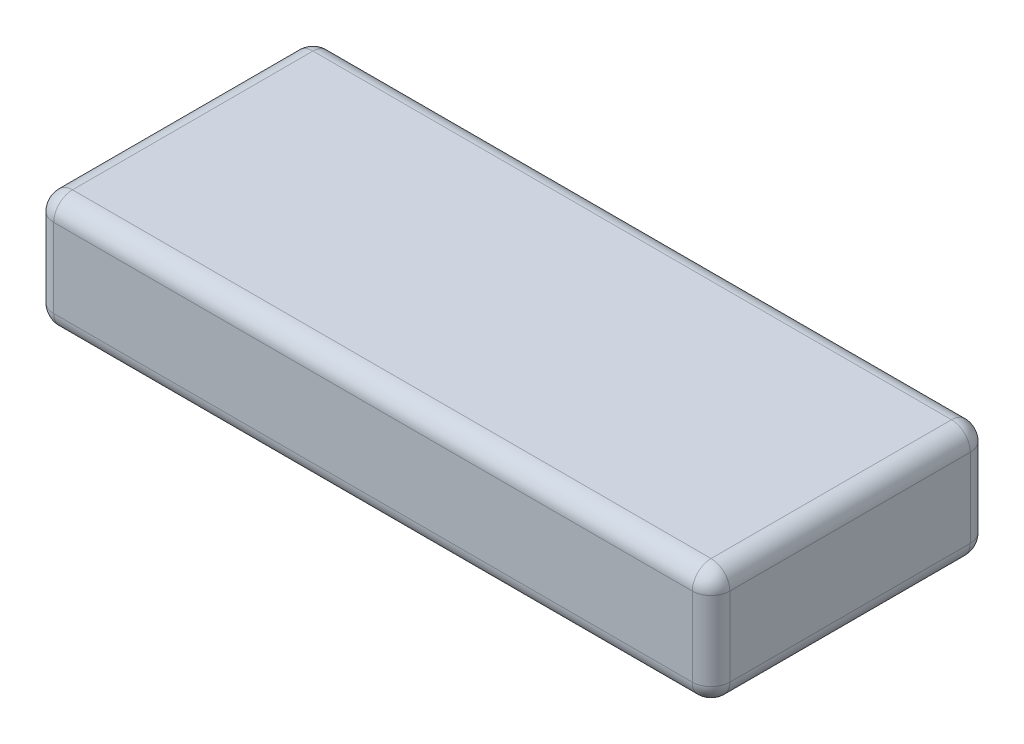
ISO-10303-21;
HEADER;
FILE_DESCRIPTION(('STEP AP214'),'2;1');
FILE_NAME('part.step','',(''),(''),'','','');
FILE_SCHEMA(('AUTOMOTIVE_DESIGN { 1 0 10303 214 1 1 1 1 }'));
ENDSEC;
DATA;
#1=APPLICATION_CONTEXT('core data for automotive mechanical design processes');
#2=APPLICATION_PROTOCOL_DEFINITION('international standard','automotive_design',2000,#1);
#3=PRODUCT_CONTEXT('',#1,'mechanical');
#4=PRODUCT('Part','Part','',(#3));
#5=PRODUCT_RELATED_PRODUCT_CATEGORY('part','',(#4));
#6=PRODUCT_DEFINITION_FORMATION('','',#4);
#7=PRODUCT_DEFINITION_CONTEXT('part definition',#1,'design');
#8=PRODUCT_DEFINITION('design','',#6,#7);
#9=PRODUCT_DEFINITION_SHAPE('','',#8);
#10=(LENGTH_UNIT() NAMED_UNIT(*) SI_UNIT(.MILLI.,.METRE.));
#11=(NAMED_UNIT(*) PLANE_ANGLE_UNIT() SI_UNIT($,.RADIAN.));
#12=(NAMED_UNIT(*) SI_UNIT($,.STERADIAN.) SOLID_ANGLE_UNIT());
#13=UNCERTAINTY_MEASURE_WITH_UNIT(LENGTH_MEASURE(1.E-05),#10,'distance_accuracy_value','');
#14=(GEOMETRIC_REPRESENTATION_CONTEXT(3) GLOBAL_UNCERTAINTY_ASSIGNED_CONTEXT((#13)) GLOBAL_UNIT_ASSIGNED_CONTEXT((#10,
#11,#12)) REPRESENTATION_CONTEXT('',''));
#15=CARTESIAN_POINT('',(0.,0.,0.));
#16=DIRECTION('',(0.,0.,1.));
#17=DIRECTION('',(1.,0.,0.));
#18=AXIS2_PLACEMENT_3D('',#15,#16,#17);
#19=CARTESIAN_POINT('',(90.,31.,37.));
#20=DIRECTION('',(-1.,0.,0.));
#21=DIRECTION('',(0.,0.,1.));
#22=AXIS2_PLACEMENT_3D('',#19,#20,#21);
#23=PLANE('',#22);
#24=DIRECTION('',(0.,-1.,0.));
#25=VECTOR('',#24,1.);
#26=CARTESIAN_POINT('',(90.,31.,32.));
#27=LINE('',#26,#25);
#28=CARTESIAN_POINT('',(90.,26.,32.));
#29=VERTEX_POINT('',#28);
#30=CARTESIAN_POINT('',(90.,5.,32.));
#31=VERTEX_POINT('',#30);
#32=EDGE_CURVE('E218',#29,#31,#27,.T.);
#33=ORIENTED_EDGE('',*,*,#32,.T.);
#34=DIRECTION('',(0.,0.,-1.));
#35=VECTOR('',#34,1.);
#36=CARTESIAN_POINT('',(90.,5.,-37.));
#37=LINE('',#36,#35);
#38=CARTESIAN_POINT('',(90.,5.,-32.));
#39=VERTEX_POINT('',#38);
#40=EDGE_CURVE('E220',#31,#39,#37,.T.);
#41=ORIENTED_EDGE('',*,*,#40,.T.);
#42=DIRECTION('',(0.,-1.,0.));
#43=VECTOR('',#42,1.);
#44=CARTESIAN_POINT('',(90.,31.,-32.));
#45=LINE('',#44,#43);
#46=CARTESIAN_POINT('',(90.,26.,-32.));
#47=VERTEX_POINT('',#46);
#48=EDGE_CURVE('E221',#39,#47,#45,.F.);
#49=ORIENTED_EDGE('',*,*,#48,.T.);
#50=DIRECTION('',(0.,0.,-1.));
#51=VECTOR('',#50,1.);
#52=CARTESIAN_POINT('',(90.,26.,37.));
#53=LINE('',#52,#51);
#54=EDGE_CURVE('E225',#47,#29,#53,.F.);
#55=ORIENTED_EDGE('',*,*,#54,.T.);
#56=EDGE_LOOP('',(#33,#41,#49,#55));
#57=FACE_BOUND('',#56,.T.);
#58=ADVANCED_FACE('F35',(#57),#23,.F.);
#59=CARTESIAN_POINT('',(-90.,31.,-37.));
#60=DIRECTION('',(0.,0.,1.));
#61=DIRECTION('',(1.,0.,0.));
#62=AXIS2_PLACEMENT_3D('',#59,#60,#61);
#63=PLANE('',#62);
#64=DIRECTION('',(0.,-1.,0.));
#65=VECTOR('',#64,1.);
#66=CARTESIAN_POINT('',(85.,31.,-37.));
#67=LINE('',#66,#65);
#68=CARTESIAN_POINT('',(85.,26.,-37.));
#69=VERTEX_POINT('',#68);
#70=CARTESIAN_POINT('',(85.,5.,-37.));
#71=VERTEX_POINT('',#70);
#72=EDGE_CURVE('E133',#69,#71,#67,.T.);
#73=ORIENTED_EDGE('',*,*,#72,.T.);
#74=DIRECTION('',(-1.,0.,0.));
#75=VECTOR('',#74,1.);
#76=CARTESIAN_POINT('',(-90.,5.,-37.));
#77=LINE('',#76,#75);
#78=CARTESIAN_POINT('',(-85.,5.,-37.));
#79=VERTEX_POINT('',#78);
#80=EDGE_CURVE('E129',#71,#79,#77,.T.);
#81=ORIENTED_EDGE('',*,*,#80,.T.);
#82=DIRECTION('',(0.,-1.,0.));
#83=VECTOR('',#82,1.);
#84=CARTESIAN_POINT('',(-85.,31.,-37.));
#85=LINE('',#84,#83);
#86=CARTESIAN_POINT('',(-85.,26.,-37.));
#87=VERTEX_POINT('',#86);
#88=EDGE_CURVE('E123',#79,#87,#85,.F.);
#89=ORIENTED_EDGE('',*,*,#88,.T.);
#90=DIRECTION('',(-1.,0.,0.));
#91=VECTOR('',#90,1.);
#92=CARTESIAN_POINT('',(-90.,26.,-37.));
#93=LINE('',#92,#91);
#94=EDGE_CURVE('E126',#87,#69,#93,.F.);
#95=ORIENTED_EDGE('',*,*,#94,.T.);
#96=EDGE_LOOP('',(#73,#81,#89,#95));
#97=FACE_BOUND('',#96,.T.);
#98=ADVANCED_FACE('F125',(#97),#63,.F.);
#99=CARTESIAN_POINT('',(-90.,31.,37.));
#100=DIRECTION('',(1.,0.,0.));
#101=DIRECTION('',(0.,0.,-1.));
#102=AXIS2_PLACEMENT_3D('',#99,#100,#101);
#103=PLANE('',#102);
#104=DIRECTION('',(0.,0.,1.));
#105=VECTOR('',#104,1.);
#106=CARTESIAN_POINT('',(-90.,26.,37.));
#107=LINE('',#106,#105);
#108=CARTESIAN_POINT('',(-90.,26.,32.));
#109=VERTEX_POINT('',#108);
#110=CARTESIAN_POINT('',(-90.,26.,-32.));
#111=VERTEX_POINT('',#110);
#112=EDGE_CURVE('E267',#109,#111,#107,.F.);
#113=ORIENTED_EDGE('',*,*,#112,.T.);
#114=DIRECTION('',(0.,-1.,0.));
#115=VECTOR('',#114,1.);
#116=CARTESIAN_POINT('',(-90.,31.,-32.));
#117=LINE('',#116,#115);
#118=CARTESIAN_POINT('',(-90.,5.,-32.));
#119=VERTEX_POINT('',#118);
#120=EDGE_CURVE('E155',#111,#119,#117,.T.);
#121=ORIENTED_EDGE('',*,*,#120,.T.);
#122=DIRECTION('',(0.,0.,1.));
#123=VECTOR('',#122,1.);
#124=CARTESIAN_POINT('',(-90.,5.,37.));
#125=LINE('',#124,#123);
#126=CARTESIAN_POINT('',(-90.,5.,32.));
#127=VERTEX_POINT('',#126);
#128=EDGE_CURVE('E275',#119,#127,#125,.T.);
#129=ORIENTED_EDGE('',*,*,#128,.T.);
#130=DIRECTION('',(0.,-1.,0.));
#131=VECTOR('',#130,1.);
#132=CARTESIAN_POINT('',(-90.,31.,32.));
#133=LINE('',#132,#131);
#134=EDGE_CURVE('E269',#127,#109,#133,.F.);
#135=ORIENTED_EDGE('',*,*,#134,.T.);
#136=EDGE_LOOP('',(#113,#121,#129,#135));
#137=FACE_BOUND('',#136,.T.);
#138=ADVANCED_FACE('F322',(#137),#103,.F.);
#139=CARTESIAN_POINT('',(-90.,31.,37.));
#140=DIRECTION('',(0.,0.,-1.));
#141=DIRECTION('',(-1.,0.,0.));
#142=AXIS2_PLACEMENT_3D('',#139,#140,#141);
#143=PLANE('',#142);
#144=DIRECTION('',(1.,0.,0.));
#145=VECTOR('',#144,1.);
#146=CARTESIAN_POINT('',(-90.,26.,37.));
#147=LINE('',#146,#145);
#148=CARTESIAN_POINT('',(85.,26.,37.));
#149=VERTEX_POINT('',#148);
#150=CARTESIAN_POINT('',(-85.,26.,37.));
#151=VERTEX_POINT('',#150);
#152=EDGE_CURVE('E278',#149,#151,#147,.F.);
#153=ORIENTED_EDGE('',*,*,#152,.T.);
#154=DIRECTION('',(0.,-1.,0.));
#155=VECTOR('',#154,1.);
#156=CARTESIAN_POINT('',(-85.,31.,37.));
#157=LINE('',#156,#155);
#158=CARTESIAN_POINT('',(-85.,5.,37.));
#159=VERTEX_POINT('',#158);
#160=EDGE_CURVE('E283',#151,#159,#157,.T.);
#161=ORIENTED_EDGE('',*,*,#160,.T.);
#162=DIRECTION('',(1.,0.,0.));
#163=VECTOR('',#162,1.);
#164=CARTESIAN_POINT('',(90.,5.,37.));
#165=LINE('',#164,#163);
#166=CARTESIAN_POINT('',(85.,5.,37.));
#167=VERTEX_POINT('',#166);
#168=EDGE_CURVE('E281',#159,#167,#165,.T.);
#169=ORIENTED_EDGE('',*,*,#168,.T.);
#170=DIRECTION('',(0.,-1.,0.));
#171=VECTOR('',#170,1.);
#172=CARTESIAN_POINT('',(85.,31.,37.));
#173=LINE('',#172,#171);
#174=EDGE_CURVE('E215',#167,#149,#173,.F.);
#175=ORIENTED_EDGE('',*,*,#174,.T.);
#176=EDGE_LOOP('',(#153,#161,#169,#175));
#177=FACE_BOUND('',#176,.T.);
#178=ADVANCED_FACE('F300',(#177),#143,.F.);
#179=CARTESIAN_POINT('',(0.,31.,0.));
#180=DIRECTION('',(0.,-1.,0.));
#181=DIRECTION('',(0.,0.,-1.));
#182=AXIS2_PLACEMENT_3D('',#179,#180,#181);
#183=PLANE('',#182);
#184=DIRECTION('',(0.,0.,1.));
#185=VECTOR('',#184,1.);
#186=CARTESIAN_POINT('',(-85.,31.,0.));
#187=LINE('',#186,#185);
#188=CARTESIAN_POINT('',(-85.,31.,-32.));
#189=VERTEX_POINT('',#188);
#190=CARTESIAN_POINT('',(-85.,31.,32.));
#191=VERTEX_POINT('',#190);
#192=EDGE_CURVE('E44',#189,#191,#187,.T.);
#193=ORIENTED_EDGE('',*,*,#192,.T.);
#194=DIRECTION('',(1.,0.,0.));
#195=VECTOR('',#194,1.);
#196=CARTESIAN_POINT('',(0.,31.,32.));
#197=LINE('',#196,#195);
#198=CARTESIAN_POINT('',(85.,31.,32.));
#199=VERTEX_POINT('',#198);
#200=EDGE_CURVE('E11',#191,#199,#197,.T.);
#201=ORIENTED_EDGE('',*,*,#200,.T.);
#202=DIRECTION('',(0.,0.,-1.));
#203=VECTOR('',#202,1.);
#204=CARTESIAN_POINT('',(85.,31.,0.));
#205=LINE('',#204,#203);
#206=CARTESIAN_POINT('',(85.,31.,-32.));
#207=VERTEX_POINT('',#206);
#208=EDGE_CURVE('E223',#199,#207,#205,.T.);
#209=ORIENTED_EDGE('',*,*,#208,.T.);
#210=DIRECTION('',(-1.,0.,0.));
#211=VECTOR('',#210,1.);
#212=CARTESIAN_POINT('',(0.,31.,-32.));
#213=LINE('',#212,#211);
#214=EDGE_CURVE('E55',#207,#189,#213,.T.);
#215=ORIENTED_EDGE('',*,*,#214,.T.);
#216=EDGE_LOOP('',(#193,#201,#209,#215));
#217=FACE_BOUND('',#216,.T.);
#218=ADVANCED_FACE('F290',(#217),#183,.F.);
#219=CARTESIAN_POINT('',(0.,0.,0.));
#220=DIRECTION('',(0.,-1.,0.));
#221=DIRECTION('',(0.,0.,-1.));
#222=AXIS2_PLACEMENT_3D('',#219,#220,#221);
#223=PLANE('',#222);
#224=DIRECTION('',(0.,0.,1.));
#225=VECTOR('',#224,1.);
#226=CARTESIAN_POINT('',(-85.,0.,-37.));
#227=LINE('',#226,#225);
#228=CARTESIAN_POINT('',(-85.,0.,32.));
#229=VERTEX_POINT('',#228);
#230=CARTESIAN_POINT('',(-85.,0.,-32.));
#231=VERTEX_POINT('',#230);
#232=EDGE_CURVE('E263',#229,#231,#227,.F.);
#233=ORIENTED_EDGE('',*,*,#232,.T.);
#234=DIRECTION('',(-1.,0.,0.));
#235=VECTOR('',#234,1.);
#236=CARTESIAN_POINT('',(90.,0.,-32.));
#237=LINE('',#236,#235);
#238=CARTESIAN_POINT('',(85.,0.,-32.));
#239=VERTEX_POINT('',#238);
#240=EDGE_CURVE('E260',#231,#239,#237,.F.);
#241=ORIENTED_EDGE('',*,*,#240,.T.);
#242=DIRECTION('',(0.,0.,-1.));
#243=VECTOR('',#242,1.);
#244=CARTESIAN_POINT('',(85.,0.,37.));
#245=LINE('',#244,#243);
#246=CARTESIAN_POINT('',(85.,0.,32.));
#247=VERTEX_POINT('',#246);
#248=EDGE_CURVE('E251',#239,#247,#245,.F.);
#249=ORIENTED_EDGE('',*,*,#248,.T.);
#250=DIRECTION('',(1.,0.,0.));
#251=VECTOR('',#250,1.);
#252=CARTESIAN_POINT('',(-90.,0.,32.));
#253=LINE('',#252,#251);
#254=EDGE_CURVE('E257',#247,#229,#253,.F.);
#255=ORIENTED_EDGE('',*,*,#254,.T.);
#256=EDGE_LOOP('',(#233,#241,#249,#255));
#257=FACE_BOUND('',#256,.T.);
#258=ADVANCED_FACE('F261',(#257),#223,.T.);
#259=CARTESIAN_POINT('',(0.,26.,32.));
#260=DIRECTION('',(1.,0.,0.));
#261=DIRECTION('',(0.,0.,-1.));
#262=AXIS2_PLACEMENT_3D('',#259,#260,#261);
#263=CYLINDRICAL_SURFACE('',#262,5.);
#264=CARTESIAN_POINT('',(85.,26.,32.));
#265=DIRECTION('',(1.,0.,0.));
#266=DIRECTION('',(0.,0.,-1.));
#267=AXIS2_PLACEMENT_3D('',#264,#265,#266);
#268=CIRCLE('',#267,5.);
#269=EDGE_CURVE('E39',#199,#149,#268,.T.);
#270=ORIENTED_EDGE('',*,*,#269,.F.);
#271=ORIENTED_EDGE('',*,*,#200,.F.);
#272=CARTESIAN_POINT('',(-85.,26.,32.));
#273=DIRECTION('',(-1.,0.,0.));
#274=DIRECTION('',(0.,0.,1.));
#275=AXIS2_PLACEMENT_3D('',#272,#273,#274);
#276=CIRCLE('',#275,5.);
#277=EDGE_CURVE('E196',#151,#191,#276,.T.);
#278=ORIENTED_EDGE('',*,*,#277,.F.);
#279=ORIENTED_EDGE('',*,*,#152,.F.);
#280=EDGE_LOOP('',(#270,#271,#278,#279));
#281=FACE_BOUND('',#280,.T.);
#282=ADVANCED_FACE('F37',(#281),#263,.T.);
#283=CARTESIAN_POINT('',(85.,26.,32.));
#284=DIRECTION('',(0.,0.,1.));
#285=DIRECTION('',(1.,0.,0.));
#286=AXIS2_PLACEMENT_3D('',#283,#284,#285);
#287=SPHERICAL_SURFACE('',#286,5.);
#288=CARTESIAN_POINT('',(85.,26.,32.));
#289=DIRECTION('',(0.,0.,1.));
#290=DIRECTION('',(1.,0.,0.));
#291=AXIS2_PLACEMENT_3D('',#288,#289,#290);
#292=CIRCLE('',#291,5.);
#293=EDGE_CURVE('E191',#199,#29,#292,.F.);
#294=ORIENTED_EDGE('',*,*,#293,.F.);
#295=ORIENTED_EDGE('',*,*,#269,.T.);
#296=CARTESIAN_POINT('',(85.,26.,32.));
#297=DIRECTION('',(0.,1.,0.));
#298=DIRECTION('',(0.,0.,1.));
#299=AXIS2_PLACEMENT_3D('',#296,#297,#298);
#300=CIRCLE('',#299,5.);
#301=EDGE_CURVE('E194',#29,#149,#300,.F.);
#302=ORIENTED_EDGE('',*,*,#301,.F.);
#303=EDGE_LOOP('',(#294,#295,#302));
#304=FACE_BOUND('',#303,.T.);
#305=ADVANCED_FACE('F207',(#304),#287,.T.);
#306=CARTESIAN_POINT('',(-85.,26.,32.));
#307=DIRECTION('',(0.,0.,1.));
#308=DIRECTION('',(1.,0.,0.));
#309=AXIS2_PLACEMENT_3D('',#306,#307,#308);
#310=SPHERICAL_SURFACE('',#309,5.);
#311=CARTESIAN_POINT('',(-85.,26.,32.));
#312=DIRECTION('',(0.,1.,0.));
#313=DIRECTION('',(0.,0.,1.));
#314=AXIS2_PLACEMENT_3D('',#311,#312,#313);
#315=CIRCLE('',#314,5.);
#316=EDGE_CURVE('E185',#151,#109,#315,.F.);
#317=ORIENTED_EDGE('',*,*,#316,.F.);
#318=ORIENTED_EDGE('',*,*,#277,.T.);
#319=CARTESIAN_POINT('',(-85.,26.,32.));
#320=DIRECTION('',(0.,0.,1.));
#321=DIRECTION('',(1.,0.,0.));
#322=AXIS2_PLACEMENT_3D('',#319,#320,#321);
#323=CIRCLE('',#322,5.);
#324=EDGE_CURVE('E188',#109,#191,#323,.F.);
#325=ORIENTED_EDGE('',*,*,#324,.F.);
#326=EDGE_LOOP('',(#317,#318,#325));
#327=FACE_BOUND('',#326,.T.);
#328=ADVANCED_FACE('F292',(#327),#310,.T.);
#329=CARTESIAN_POINT('',(85.,31.,32.));
#330=DIRECTION('',(0.,-1.,0.));
#331=DIRECTION('',(0.,0.,-1.));
#332=AXIS2_PLACEMENT_3D('',#329,#330,#331);
#333=CYLINDRICAL_SURFACE('',#332,5.);
#334=ORIENTED_EDGE('',*,*,#301,.T.);
#335=ORIENTED_EDGE('',*,*,#174,.F.);
#336=CARTESIAN_POINT('',(85.,5.,32.));
#337=DIRECTION('',(0.,-1.,0.));
#338=DIRECTION('',(0.,0.,-1.));
#339=AXIS2_PLACEMENT_3D('',#336,#337,#338);
#340=CIRCLE('',#339,5.);
#341=EDGE_CURVE('E179',#31,#167,#340,.T.);
#342=ORIENTED_EDGE('',*,*,#341,.F.);
#343=ORIENTED_EDGE('',*,*,#32,.F.);
#344=EDGE_LOOP('',(#334,#335,#342,#343));
#345=FACE_BOUND('',#344,.T.);
#346=ADVANCED_FACE('F213',(#345),#333,.T.);
#347=CARTESIAN_POINT('',(85.,26.,0.));
#348=DIRECTION('',(0.,0.,-1.));
#349=DIRECTION('',(-1.,0.,0.));
#350=AXIS2_PLACEMENT_3D('',#347,#348,#349);
#351=CYLINDRICAL_SURFACE('',#350,5.);
#352=ORIENTED_EDGE('',*,*,#293,.T.);
#353=ORIENTED_EDGE('',*,*,#54,.F.);
#354=CARTESIAN_POINT('',(85.,26.,-32.));
#355=DIRECTION('',(0.,0.,-1.));
#356=DIRECTION('',(-1.,0.,0.));
#357=AXIS2_PLACEMENT_3D('',#354,#355,#356);
#358=CIRCLE('',#357,5.);
#359=EDGE_CURVE('E176',#207,#47,#358,.T.);
#360=ORIENTED_EDGE('',*,*,#359,.F.);
#361=ORIENTED_EDGE('',*,*,#208,.F.);
#362=EDGE_LOOP('',(#352,#353,#360,#361));
#363=FACE_BOUND('',#362,.T.);
#364=ADVANCED_FACE('F289',(#363),#351,.T.);
#365=CARTESIAN_POINT('',(0.,26.,-32.));
#366=DIRECTION('',(-1.,0.,0.));
#367=DIRECTION('',(0.,0.,1.));
#368=AXIS2_PLACEMENT_3D('',#365,#366,#367);
#369=CYLINDRICAL_SURFACE('',#368,5.);
#370=CARTESIAN_POINT('',(-85.,26.,-32.));
#371=DIRECTION('',(-1.,0.,0.));
#372=DIRECTION('',(0.,0.,1.));
#373=AXIS2_PLACEMENT_3D('',#370,#371,#372);
#374=CIRCLE('',#373,5.);
#375=EDGE_CURVE('E139',#189,#87,#374,.T.);
#376=ORIENTED_EDGE('',*,*,#375,.F.);
#377=ORIENTED_EDGE('',*,*,#214,.F.);
#378=CARTESIAN_POINT('',(85.,26.,-32.));
#379=DIRECTION('',(1.,0.,0.));
#380=DIRECTION('',(0.,0.,-1.));
#381=AXIS2_PLACEMENT_3D('',#378,#379,#380);
#382=CIRCLE('',#381,5.);
#383=EDGE_CURVE('E142',#69,#207,#382,.T.);
#384=ORIENTED_EDGE('',*,*,#383,.F.);
#385=ORIENTED_EDGE('',*,*,#94,.F.);
#386=EDGE_LOOP('',(#376,#377,#384,#385));
#387=FACE_BOUND('',#386,.T.);
#388=ADVANCED_FACE('F138',(#387),#369,.T.);
#389=CARTESIAN_POINT('',(-85.,26.,0.));
#390=DIRECTION('',(0.,0.,1.));
#391=DIRECTION('',(1.,0.,0.));
#392=AXIS2_PLACEMENT_3D('',#389,#390,#391);
#393=CYLINDRICAL_SURFACE('',#392,5.);
#394=ORIENTED_EDGE('',*,*,#324,.T.);
#395=ORIENTED_EDGE('',*,*,#192,.F.);
#396=CARTESIAN_POINT('',(-85.,26.,-32.));
#397=DIRECTION('',(0.,0.,-1.));
#398=DIRECTION('',(0.,1.,0.));
#399=AXIS2_PLACEMENT_3D('',#396,#397,#398);
#400=CIRCLE('',#399,5.);
#401=EDGE_CURVE('E151',#111,#189,#400,.T.);
#402=ORIENTED_EDGE('',*,*,#401,.F.);
#403=ORIENTED_EDGE('',*,*,#112,.F.);
#404=EDGE_LOOP('',(#394,#395,#402,#403));
#405=FACE_BOUND('',#404,.T.);
#406=ADVANCED_FACE('F427',(#405),#393,.T.);
#407=CARTESIAN_POINT('',(-85.,31.,32.));
#408=DIRECTION('',(0.,-1.,0.));
#409=DIRECTION('',(0.,0.,-1.));
#410=AXIS2_PLACEMENT_3D('',#407,#408,#409);
#411=CYLINDRICAL_SURFACE('',#410,5.);
#412=ORIENTED_EDGE('',*,*,#316,.T.);
#413=ORIENTED_EDGE('',*,*,#134,.F.);
#414=CARTESIAN_POINT('',(-85.,5.,32.));
#415=DIRECTION('',(0.,-1.,0.));
#416=DIRECTION('',(0.,0.,-1.));
#417=AXIS2_PLACEMENT_3D('',#414,#415,#416);
#418=CIRCLE('',#417,5.);
#419=EDGE_CURVE('E171',#159,#127,#418,.T.);
#420=ORIENTED_EDGE('',*,*,#419,.F.);
#421=ORIENTED_EDGE('',*,*,#160,.F.);
#422=EDGE_LOOP('',(#412,#413,#420,#421));
#423=FACE_BOUND('',#422,.T.);
#424=ADVANCED_FACE('F297',(#423),#411,.T.);
#425=CARTESIAN_POINT('',(-90.,5.,32.));
#426=DIRECTION('',(-1.,0.,0.));
#427=DIRECTION('',(0.,0.,1.));
#428=AXIS2_PLACEMENT_3D('',#425,#426,#427);
#429=CYLINDRICAL_SURFACE('',#428,5.);
#430=CARTESIAN_POINT('',(85.,5.,32.));
#431=DIRECTION('',(1.,0.,0.));
#432=DIRECTION('',(0.,0.,-1.));
#433=AXIS2_PLACEMENT_3D('',#430,#431,#432);
#434=CIRCLE('',#433,5.);
#435=EDGE_CURVE('E182',#167,#247,#434,.T.);
#436=ORIENTED_EDGE('',*,*,#435,.F.);
#437=ORIENTED_EDGE('',*,*,#168,.F.);
#438=CARTESIAN_POINT('',(-85.,5.,32.));
#439=DIRECTION('',(-1.,0.,0.));
#440=DIRECTION('',(0.,0.,1.));
#441=AXIS2_PLACEMENT_3D('',#438,#439,#440);
#442=CIRCLE('',#441,5.);
#443=EDGE_CURVE('E169',#229,#159,#442,.T.);
#444=ORIENTED_EDGE('',*,*,#443,.F.);
#445=ORIENTED_EDGE('',*,*,#254,.F.);
#446=EDGE_LOOP('',(#436,#437,#444,#445));
#447=FACE_BOUND('',#446,.T.);
#448=ADVANCED_FACE('F303',(#447),#429,.T.);
#449=CARTESIAN_POINT('',(85.,5.,32.));
#450=DIRECTION('',(0.,0.,1.));
#451=DIRECTION('',(1.,0.,0.));
#452=AXIS2_PLACEMENT_3D('',#449,#450,#451);
#453=SPHERICAL_SURFACE('',#452,5.);
#454=ORIENTED_EDGE('',*,*,#341,.T.);
#455=ORIENTED_EDGE('',*,*,#435,.T.);
#456=CARTESIAN_POINT('',(85.,5.,32.));
#457=DIRECTION('',(0.,0.,1.));
#458=DIRECTION('',(1.,0.,0.));
#459=AXIS2_PLACEMENT_3D('',#456,#457,#458);
#460=CIRCLE('',#459,5.);
#461=EDGE_CURVE('E160',#31,#247,#460,.F.);
#462=ORIENTED_EDGE('',*,*,#461,.F.);
#463=EDGE_LOOP('',(#454,#455,#462));
#464=FACE_BOUND('',#463,.T.);
#465=ADVANCED_FACE('F306',(#464),#453,.T.);
#466=CARTESIAN_POINT('',(85.,26.,-32.));
#467=DIRECTION('',(0.,0.,1.));
#468=DIRECTION('',(1.,0.,0.));
#469=AXIS2_PLACEMENT_3D('',#466,#467,#468);
#470=SPHERICAL_SURFACE('',#469,5.);
#471=ORIENTED_EDGE('',*,*,#383,.T.);
#472=ORIENTED_EDGE('',*,*,#359,.T.);
#473=CARTESIAN_POINT('',(85.,26.,-32.));
#474=DIRECTION('',(0.,1.,0.));
#475=DIRECTION('',(0.,0.,1.));
#476=AXIS2_PLACEMENT_3D('',#473,#474,#475);
#477=CIRCLE('',#476,5.);
#478=EDGE_CURVE('E156',#69,#47,#477,.F.);
#479=ORIENTED_EDGE('',*,*,#478,.F.);
#480=EDGE_LOOP('',(#471,#472,#479));
#481=FACE_BOUND('',#480,.T.);
#482=ADVANCED_FACE('F308',(#481),#470,.T.);
#483=CARTESIAN_POINT('',(-85.,26.,-32.));
#484=DIRECTION('',(0.,0.,1.));
#485=DIRECTION('',(1.,0.,0.));
#486=AXIS2_PLACEMENT_3D('',#483,#484,#485);
#487=SPHERICAL_SURFACE('',#486,5.);
#488=ORIENTED_EDGE('',*,*,#401,.T.);
#489=ORIENTED_EDGE('',*,*,#375,.T.);
#490=CARTESIAN_POINT('',(-85.,26.,-32.));
#491=DIRECTION('',(0.,1.,0.));
#492=DIRECTION('',(0.,0.,1.));
#493=AXIS2_PLACEMENT_3D('',#490,#491,#492);
#494=CIRCLE('',#493,5.);
#495=EDGE_CURVE('E148',#111,#87,#494,.F.);
#496=ORIENTED_EDGE('',*,*,#495,.F.);
#497=EDGE_LOOP('',(#488,#489,#496));
#498=FACE_BOUND('',#497,.T.);
#499=ADVANCED_FACE('F147',(#498),#487,.T.);
#500=CARTESIAN_POINT('',(-85.,5.,32.));
#501=DIRECTION('',(0.,0.,1.));
#502=DIRECTION('',(1.,0.,0.));
#503=AXIS2_PLACEMENT_3D('',#500,#501,#502);
#504=SPHERICAL_SURFACE('',#503,5.);
#505=ORIENTED_EDGE('',*,*,#443,.T.);
#506=ORIENTED_EDGE('',*,*,#419,.T.);
#507=CARTESIAN_POINT('',(-85.,5.,32.));
#508=DIRECTION('',(0.,0.,1.));
#509=DIRECTION('',(1.,0.,0.));
#510=AXIS2_PLACEMENT_3D('',#507,#508,#509);
#511=CIRCLE('',#510,5.);
#512=EDGE_CURVE('E157',#229,#127,#511,.F.);
#513=ORIENTED_EDGE('',*,*,#512,.F.);
#514=EDGE_LOOP('',(#505,#506,#513));
#515=FACE_BOUND('',#514,.T.);
#516=ADVANCED_FACE('F347',(#515),#504,.T.);
#517=CARTESIAN_POINT('',(85.,5.,37.));
#518=DIRECTION('',(0.,0.,1.));
#519=DIRECTION('',(1.,0.,0.));
#520=AXIS2_PLACEMENT_3D('',#517,#518,#519);
#521=CYLINDRICAL_SURFACE('',#520,5.);
#522=ORIENTED_EDGE('',*,*,#461,.T.);
#523=ORIENTED_EDGE('',*,*,#248,.F.);
#524=CARTESIAN_POINT('',(85.,5.,-32.));
#525=DIRECTION('',(0.,0.,-1.));
#526=DIRECTION('',(-1.,0.,0.));
#527=AXIS2_PLACEMENT_3D('',#524,#525,#526);
#528=CIRCLE('',#527,5.);
#529=EDGE_CURVE('E163',#39,#239,#528,.T.);
#530=ORIENTED_EDGE('',*,*,#529,.F.);
#531=ORIENTED_EDGE('',*,*,#40,.F.);
#532=EDGE_LOOP('',(#522,#523,#530,#531));
#533=FACE_BOUND('',#532,.T.);
#534=ADVANCED_FACE('F253',(#533),#521,.T.);
#535=CARTESIAN_POINT('',(85.,31.,-32.));
#536=DIRECTION('',(0.,-1.,0.));
#537=DIRECTION('',(0.,0.,-1.));
#538=AXIS2_PLACEMENT_3D('',#535,#536,#537);
#539=CYLINDRICAL_SURFACE('',#538,5.);
#540=ORIENTED_EDGE('',*,*,#478,.T.);
#541=ORIENTED_EDGE('',*,*,#48,.F.);
#542=CARTESIAN_POINT('',(85.,5.,-32.));
#543=DIRECTION('',(0.,-1.,0.));
#544=DIRECTION('',(0.,0.,-1.));
#545=AXIS2_PLACEMENT_3D('',#542,#543,#544);
#546=CIRCLE('',#545,5.);
#547=EDGE_CURVE('E241',#71,#39,#546,.T.);
#548=ORIENTED_EDGE('',*,*,#547,.F.);
#549=ORIENTED_EDGE('',*,*,#72,.F.);
#550=EDGE_LOOP('',(#540,#541,#548,#549));
#551=FACE_BOUND('',#550,.T.);
#552=ADVANCED_FACE('F341',(#551),#539,.T.);
#553=CARTESIAN_POINT('',(-85.,31.,-32.));
#554=DIRECTION('',(0.,-1.,0.));
#555=DIRECTION('',(0.,0.,-1.));
#556=AXIS2_PLACEMENT_3D('',#553,#554,#555);
#557=CYLINDRICAL_SURFACE('',#556,5.);
#558=ORIENTED_EDGE('',*,*,#495,.T.);
#559=ORIENTED_EDGE('',*,*,#88,.F.);
#560=CARTESIAN_POINT('',(-85.,5.,-32.));
#561=DIRECTION('',(0.,-1.,0.));
#562=DIRECTION('',(0.,0.,-1.));
#563=AXIS2_PLACEMENT_3D('',#560,#561,#562);
#564=CIRCLE('',#563,5.);
#565=EDGE_CURVE('E238',#119,#79,#564,.T.);
#566=ORIENTED_EDGE('',*,*,#565,.F.);
#567=ORIENTED_EDGE('',*,*,#120,.F.);
#568=EDGE_LOOP('',(#558,#559,#566,#567));
#569=FACE_BOUND('',#568,.T.);
#570=ADVANCED_FACE('F153',(#569),#557,.T.);
#571=CARTESIAN_POINT('',(-85.,5.,37.));
#572=DIRECTION('',(0.,0.,-1.));
#573=DIRECTION('',(-1.,0.,0.));
#574=AXIS2_PLACEMENT_3D('',#571,#572,#573);
#575=CYLINDRICAL_SURFACE('',#574,5.);
#576=ORIENTED_EDGE('',*,*,#512,.T.);
#577=ORIENTED_EDGE('',*,*,#128,.F.);
#578=CARTESIAN_POINT('',(-85.,5.,-32.));
#579=DIRECTION('',(0.,0.,-1.));
#580=DIRECTION('',(-1.,0.,0.));
#581=AXIS2_PLACEMENT_3D('',#578,#579,#580);
#582=CIRCLE('',#581,5.);
#583=EDGE_CURVE('E236',#231,#119,#582,.T.);
#584=ORIENTED_EDGE('',*,*,#583,.F.);
#585=ORIENTED_EDGE('',*,*,#232,.F.);
#586=EDGE_LOOP('',(#576,#577,#584,#585));
#587=FACE_BOUND('',#586,.T.);
#588=ADVANCED_FACE('F335',(#587),#575,.T.);
#589=CARTESIAN_POINT('',(85.,5.,-32.));
#590=DIRECTION('',(0.,0.,1.));
#591=DIRECTION('',(1.,0.,0.));
#592=AXIS2_PLACEMENT_3D('',#589,#590,#591);
#593=SPHERICAL_SURFACE('',#592,5.);
#594=ORIENTED_EDGE('',*,*,#547,.T.);
#595=ORIENTED_EDGE('',*,*,#529,.T.);
#596=CARTESIAN_POINT('',(85.,5.,-32.));
#597=DIRECTION('',(1.,0.,0.));
#598=DIRECTION('',(0.,0.,-1.));
#599=AXIS2_PLACEMENT_3D('',#596,#597,#598);
#600=CIRCLE('',#599,5.);
#601=EDGE_CURVE('E234',#71,#239,#600,.F.);
#602=ORIENTED_EDGE('',*,*,#601,.F.);
#603=EDGE_LOOP('',(#594,#595,#602));
#604=FACE_BOUND('',#603,.T.);
#605=ADVANCED_FACE('F248',(#604),#593,.T.);
#606=CARTESIAN_POINT('',(-85.,5.,-32.));
#607=DIRECTION('',(0.,0.,1.));
#608=DIRECTION('',(1.,0.,0.));
#609=AXIS2_PLACEMENT_3D('',#606,#607,#608);
#610=SPHERICAL_SURFACE('',#609,5.);
#611=ORIENTED_EDGE('',*,*,#583,.T.);
#612=ORIENTED_EDGE('',*,*,#565,.T.);
#613=CARTESIAN_POINT('',(-85.,5.,-32.));
#614=DIRECTION('',(-1.,0.,0.));
#615=DIRECTION('',(0.,0.,1.));
#616=AXIS2_PLACEMENT_3D('',#613,#614,#615);
#617=CIRCLE('',#616,5.);
#618=EDGE_CURVE('E232',#231,#79,#617,.F.);
#619=ORIENTED_EDGE('',*,*,#618,.F.);
#620=EDGE_LOOP('',(#611,#612,#619));
#621=FACE_BOUND('',#620,.T.);
#622=ADVANCED_FACE('F329',(#621),#610,.T.);
#623=CARTESIAN_POINT('',(-90.,5.,-32.));
#624=DIRECTION('',(1.,0.,0.));
#625=DIRECTION('',(0.,0.,-1.));
#626=AXIS2_PLACEMENT_3D('',#623,#624,#625);
#627=CYLINDRICAL_SURFACE('',#626,5.);
#628=ORIENTED_EDGE('',*,*,#601,.T.);
#629=ORIENTED_EDGE('',*,*,#240,.F.);
#630=ORIENTED_EDGE('',*,*,#618,.T.);
#631=ORIENTED_EDGE('',*,*,#80,.F.);
#632=EDGE_LOOP('',(#628,#629,#630,#631));
#633=FACE_BOUND('',#632,.T.);
#634=ADVANCED_FACE('F326',(#633),#627,.T.);
#635=CLOSED_SHELL('',(#58,#98,#138,#178,#218,#258,#282,#305,#328,#346,#364,#388,#406,#424,#448,
#465,#482,#499,#516,#534,#552,#570,#588,#605,#622,#634));
#636=MANIFOLD_SOLID_BREP('B2',#635);
#637=ADVANCED_BREP_SHAPE_REPRESENTATION('',(#18,#636),#14);
#638=SHAPE_DEFINITION_REPRESENTATION(#9,#637);
ENDSEC;
END-ISO-10303-21;
